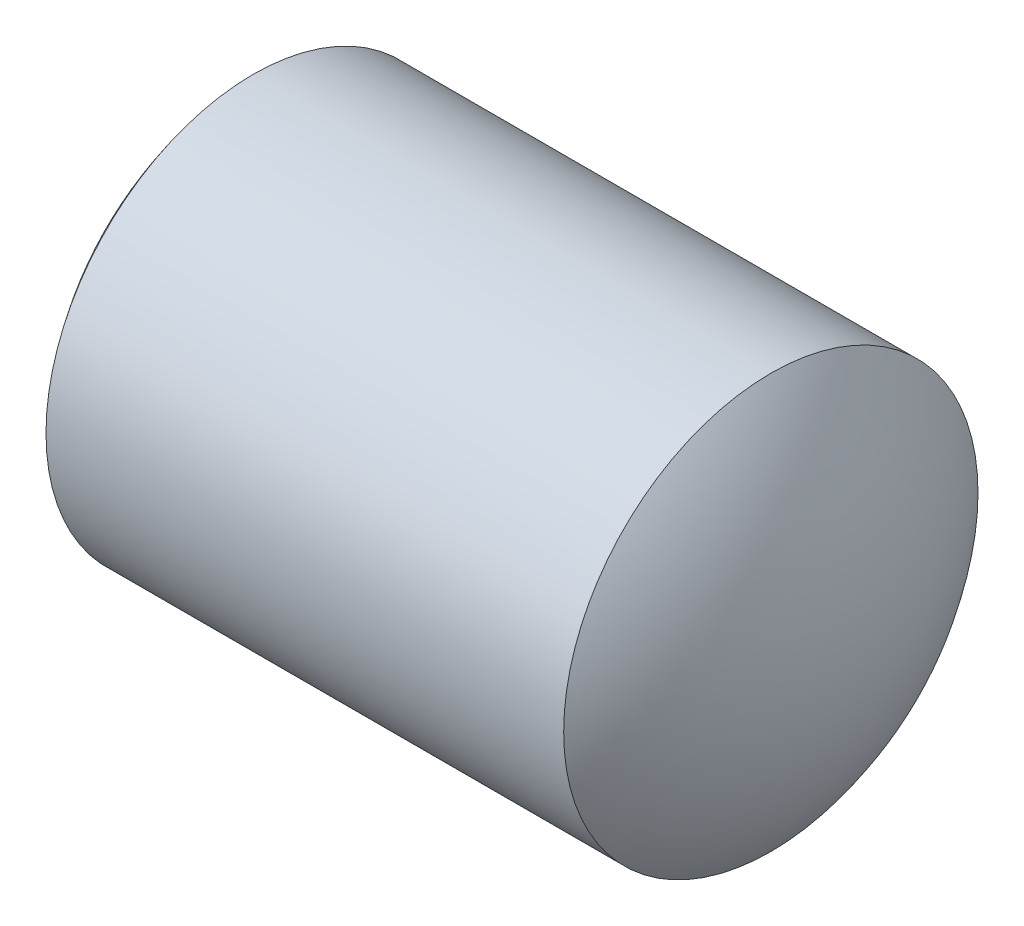
ISO-10303-21;
HEADER;
FILE_DESCRIPTION(('STEP AP214'),'2;1');
FILE_NAME('part.step','',(''),(''),'','','');
FILE_SCHEMA(('AUTOMOTIVE_DESIGN { 1 0 10303 214 1 1 1 1 }'));
ENDSEC;
DATA;
#1=APPLICATION_CONTEXT('core data for automotive mechanical design processes');
#2=APPLICATION_PROTOCOL_DEFINITION('international standard','automotive_design',2000,#1);
#3=PRODUCT_CONTEXT('',#1,'mechanical');
#4=PRODUCT('Part','Part','',(#3));
#5=PRODUCT_RELATED_PRODUCT_CATEGORY('part','',(#4));
#6=PRODUCT_DEFINITION_FORMATION('','',#4);
#7=PRODUCT_DEFINITION_CONTEXT('part definition',#1,'design');
#8=PRODUCT_DEFINITION('design','',#6,#7);
#9=PRODUCT_DEFINITION_SHAPE('','',#8);
#10=(LENGTH_UNIT() NAMED_UNIT(*) SI_UNIT(.MILLI.,.METRE.));
#11=(NAMED_UNIT(*) PLANE_ANGLE_UNIT() SI_UNIT($,.RADIAN.));
#12=(NAMED_UNIT(*) SI_UNIT($,.STERADIAN.) SOLID_ANGLE_UNIT());
#13=UNCERTAINTY_MEASURE_WITH_UNIT(LENGTH_MEASURE(1.E-05),#10,'distance_accuracy_value','');
#14=(GEOMETRIC_REPRESENTATION_CONTEXT(3) GLOBAL_UNCERTAINTY_ASSIGNED_CONTEXT((#13)) GLOBAL_UNIT_ASSIGNED_CONTEXT((#10,
#11,#12)) REPRESENTATION_CONTEXT('',''));
#15=CARTESIAN_POINT('',(0.,0.,0.));
#16=DIRECTION('',(0.,0.,1.));
#17=DIRECTION('',(1.,0.,0.));
#18=AXIS2_PLACEMENT_3D('',#15,#16,#17);
#19=CARTESIAN_POINT('',(0.,0.,0.));
#20=DIRECTION('',(-1.,0.,0.));
#21=DIRECTION('',(0.,1.,0.));
#22=AXIS2_PLACEMENT_3D('',#19,#20,#21);
#23=SPHERICAL_SURFACE('',#22,4.);
#24=CARTESIAN_POINT('',(-3.12290418192051,0.,0.));
#25=DIRECTION('',(-1.,0.,0.));
#26=DIRECTION('',(0.,0.,1.));
#27=AXIS2_PLACEMENT_3D('',#24,#25,#26);
#28=CIRCLE('',#27,2.49949384286967);
#29=CARTESIAN_POINT('',(-3.12290418192051,0.,2.49949384286967));
#30=VERTEX_POINT('',#29);
#31=EDGE_CURVE('E46',#30,#30,#28,.T.);
#32=ORIENTED_EDGE('',*,*,#31,.T.);
#33=EDGE_LOOP('',(#32));
#34=FACE_BOUND('',#33,.T.);
#35=ADVANCED_FACE('F39',(#34),#23,.T.);
#36=CARTESIAN_POINT('',(0.,0.,0.));
#37=DIRECTION('',(-1.,0.,0.));
#38=DIRECTION('',(0.,1.,0.));
#39=AXIS2_PLACEMENT_3D('',#36,#37,#38);
#40=SPHERICAL_SURFACE('',#39,4.);
#41=CARTESIAN_POINT('',(3.12290418192051,0.,0.));
#42=DIRECTION('',(-1.,0.,0.));
#43=DIRECTION('',(0.,0.,1.));
#44=AXIS2_PLACEMENT_3D('',#41,#42,#43);
#45=CIRCLE('',#44,2.49949384286968);
#46=CARTESIAN_POINT('',(3.12290418192051,0.,2.49949384286968));
#47=VERTEX_POINT('',#46);
#48=EDGE_CURVE('E10',#47,#47,#45,.T.);
#49=ORIENTED_EDGE('',*,*,#48,.F.);
#50=EDGE_LOOP('',(#49));
#51=FACE_BOUND('',#50,.T.);
#52=ADVANCED_FACE('F56',(#51),#40,.T.);
#53=CARTESIAN_POINT('',(-4.63604151991589,0.,0.));
#54=DIRECTION('',(-1.,0.,0.));
#55=DIRECTION('',(0.,0.,1.));
#56=AXIS2_PLACEMENT_3D('',#53,#54,#55);
#57=CYLINDRICAL_SURFACE('',#56,2.49949384286967);
#58=ORIENTED_EDGE('',*,*,#31,.F.);
#59=EDGE_LOOP('',(#58));
#60=FACE_BOUND('',#59,.T.);
#61=ORIENTED_EDGE('',*,*,#48,.T.);
#62=EDGE_LOOP('',(#61));
#63=FACE_BOUND('',#62,.T.);
#64=ADVANCED_FACE('F54',(#60,#63),#57,.T.);
#65=CLOSED_SHELL('',(#35,#52,#64));
#66=MANIFOLD_SOLID_BREP('B2',#65);
#67=ADVANCED_BREP_SHAPE_REPRESENTATION('',(#18,#66),#14);
#68=SHAPE_DEFINITION_REPRESENTATION(#9,#67);
ENDSEC;
END-ISO-10303-21;
